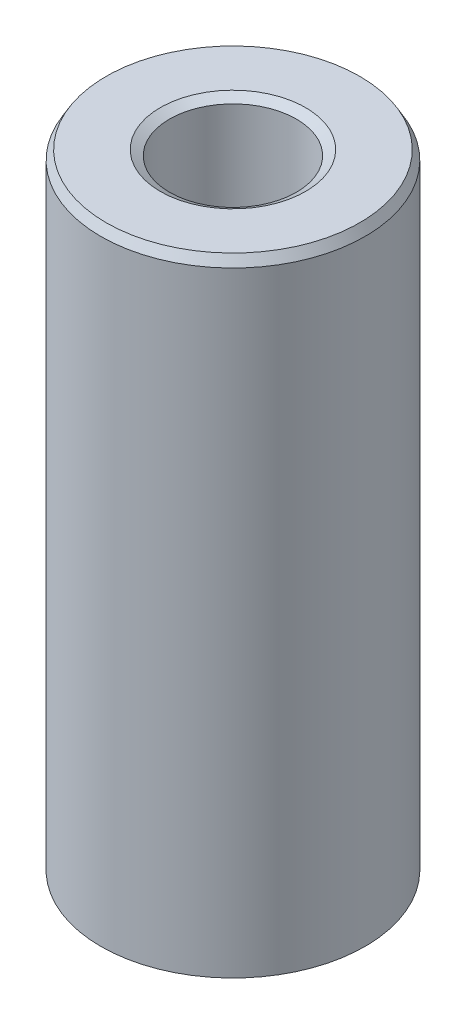
ISO-10303-21;
HEADER;
FILE_DESCRIPTION(('STEP AP214'),'2;1');
FILE_NAME('part.step','',(''),(''),'','','');
FILE_SCHEMA(('AUTOMOTIVE_DESIGN { 1 0 10303 214 1 1 1 1 }'));
ENDSEC;
DATA;
#1=APPLICATION_CONTEXT('core data for automotive mechanical design processes');
#2=APPLICATION_PROTOCOL_DEFINITION('international standard','automotive_design',2000,#1);
#3=PRODUCT_CONTEXT('',#1,'mechanical');
#4=PRODUCT('Part','Part','',(#3));
#5=PRODUCT_RELATED_PRODUCT_CATEGORY('part','',(#4));
#6=PRODUCT_DEFINITION_FORMATION('','',#4);
#7=PRODUCT_DEFINITION_CONTEXT('part definition',#1,'design');
#8=PRODUCT_DEFINITION('design','',#6,#7);
#9=PRODUCT_DEFINITION_SHAPE('','',#8);
#10=(LENGTH_UNIT() NAMED_UNIT(*) SI_UNIT(.MILLI.,.METRE.));
#11=(NAMED_UNIT(*) PLANE_ANGLE_UNIT() SI_UNIT($,.RADIAN.));
#12=(NAMED_UNIT(*) SI_UNIT($,.STERADIAN.) SOLID_ANGLE_UNIT());
#13=UNCERTAINTY_MEASURE_WITH_UNIT(LENGTH_MEASURE(1.E-05),#10,'distance_accuracy_value','');
#14=(GEOMETRIC_REPRESENTATION_CONTEXT(3) GLOBAL_UNCERTAINTY_ASSIGNED_CONTEXT((#13)) GLOBAL_UNIT_ASSIGNED_CONTEXT((#10,
#11,#12)) REPRESENTATION_CONTEXT('',''));
#15=CARTESIAN_POINT('',(0.,0.,0.));
#16=DIRECTION('',(0.,0.,1.));
#17=DIRECTION('',(1.,0.,0.));
#18=AXIS2_PLACEMENT_3D('',#15,#16,#17);
#19=CARTESIAN_POINT('',(0.,166.715926117565,0.));
#20=DIRECTION('',(0.,-1.,0.));
#21=DIRECTION('',(0.,0.,-1.));
#22=AXIS2_PLACEMENT_3D('',#19,#20,#21);
#23=CYLINDRICAL_SURFACE('',#22,35.);
#24=CARTESIAN_POINT('',(0.,1.41036586616741,0.));
#25=DIRECTION('',(0.,1.,0.));
#26=DIRECTION('',(0.,0.,1.));
#27=AXIS2_PLACEMENT_3D('',#24,#25,#26);
#28=CIRCLE('',#27,35.);
#29=CARTESIAN_POINT('',(0.,1.41036586616741,35.));
#30=VERTEX_POINT('',#29);
#31=EDGE_CURVE('E10',#30,#30,#28,.T.);
#32=ORIENTED_EDGE('',*,*,#31,.T.);
#33=EDGE_LOOP('',(#32));
#34=FACE_BOUND('',#33,.T.);
#35=CARTESIAN_POINT('',(0.,164.273100780102,0.));
#36=DIRECTION('',(0.,1.,0.));
#37=DIRECTION('',(0.,0.,1.));
#38=AXIS2_PLACEMENT_3D('',#35,#36,#37);
#39=CIRCLE('',#38,35.);
#40=CARTESIAN_POINT('',(0.,164.273100780102,35.));
#41=VERTEX_POINT('',#40);
#42=EDGE_CURVE('E50',#41,#41,#39,.F.);
#43=ORIENTED_EDGE('',*,*,#42,.T.);
#44=EDGE_LOOP('',(#43));
#45=FACE_BOUND('',#44,.T.);
#46=ADVANCED_FACE('F39',(#34,#45),#23,.T.);
#47=CARTESIAN_POINT('',(0.,166.715926117565,0.));
#48=DIRECTION('',(0.,1.,0.));
#49=DIRECTION('',(0.,0.,1.));
#50=AXIS2_PLACEMENT_3D('',#47,#48,#49);
#51=PLANE('',#50);
#52=CARTESIAN_POINT('',(0.,166.715926117565,0.));
#53=DIRECTION('',(0.,1.,0.));
#54=DIRECTION('',(0.,0.,1.));
#55=AXIS2_PLACEMENT_3D('',#52,#53,#54);
#56=CIRCLE('',#55,19.2481001896957);
#57=CARTESIAN_POINT('',(0.,166.715926117565,19.2481001896957));
#58=VERTEX_POINT('',#57);
#59=EDGE_CURVE('E58',#58,#58,#56,.F.);
#60=ORIENTED_EDGE('',*,*,#59,.T.);
#61=EDGE_LOOP('',(#60));
#62=FACE_BOUND('',#61,.T.);
#63=CARTESIAN_POINT('',(0.,166.715926117565,0.));
#64=DIRECTION('',(0.,1.,0.));
#65=DIRECTION('',(0.,0.,1.));
#66=AXIS2_PLACEMENT_3D('',#63,#64,#65);
#67=CIRCLE('',#66,33.5896341338326);
#68=CARTESIAN_POINT('',(0.,166.715926117565,33.5896341338326));
#69=VERTEX_POINT('',#68);
#70=EDGE_CURVE('E61',#69,#69,#67,.T.);
#71=ORIENTED_EDGE('',*,*,#70,.T.);
#72=EDGE_LOOP('',(#71));
#73=FACE_BOUND('',#72,.T.);
#74=ADVANCED_FACE('F88',(#62,#73),#51,.T.);
#75=CARTESIAN_POINT('',(0.,0.,0.));
#76=DIRECTION('',(0.,1.,0.));
#77=DIRECTION('',(0.,0.,1.));
#78=AXIS2_PLACEMENT_3D('',#75,#76,#77);
#79=PLANE('',#78);
#80=CARTESIAN_POINT('',(0.,0.,0.));
#81=DIRECTION('',(0.,1.,0.));
#82=DIRECTION('',(0.,0.,1.));
#83=AXIS2_PLACEMENT_3D('',#80,#81,#82);
#84=CIRCLE('',#83,18.2156407184002);
#85=CARTESIAN_POINT('',(0.,0.,-18.2156407184002));
#86=VERTEX_POINT('',#85);
#87=EDGE_CURVE('E51',#86,#86,#84,.T.);
#88=ORIENTED_EDGE('',*,*,#87,.T.);
#89=EDGE_LOOP('',(#88));
#90=FACE_BOUND('',#89,.T.);
#91=CARTESIAN_POINT('',(0.,0.,0.));
#92=DIRECTION('',(0.,1.,0.));
#93=DIRECTION('',(0.,0.,1.));
#94=AXIS2_PLACEMENT_3D('',#91,#92,#93);
#95=CIRCLE('',#94,32.5571746625372);
#96=CARTESIAN_POINT('',(0.,0.,32.5571746625372));
#97=VERTEX_POINT('',#96);
#98=EDGE_CURVE('E54',#97,#97,#95,.F.);
#99=ORIENTED_EDGE('',*,*,#98,.T.);
#100=EDGE_LOOP('',(#99));
#101=FACE_BOUND('',#100,.T.);
#102=ADVANCED_FACE('F83',(#90,#101),#79,.F.);
#103=CARTESIAN_POINT('',(0.,166.715926117565,0.));
#104=DIRECTION('',(0.,-1.,0.));
#105=DIRECTION('',(0.,0.,-1.));
#106=AXIS2_PLACEMENT_3D('',#103,#104,#105);
#107=CYLINDRICAL_SURFACE('',#106,16.8052748522328);
#108=CARTESIAN_POINT('',(0.,165.305560251397,0.));
#109=DIRECTION('',(0.,1.,0.));
#110=DIRECTION('',(0.,0.,1.));
#111=AXIS2_PLACEMENT_3D('',#108,#109,#110);
#112=CIRCLE('',#111,16.8052748522328);
#113=CARTESIAN_POINT('',(0.,165.305560251397,16.8052748522328));
#114=VERTEX_POINT('',#113);
#115=EDGE_CURVE('E67',#114,#114,#112,.T.);
#116=ORIENTED_EDGE('',*,*,#115,.T.);
#117=EDGE_LOOP('',(#116));
#118=FACE_BOUND('',#117,.T.);
#119=CARTESIAN_POINT('',(0.,2.44282533746285,0.));
#120=DIRECTION('',(0.,1.,0.));
#121=DIRECTION('',(0.,0.,1.));
#122=AXIS2_PLACEMENT_3D('',#119,#120,#121);
#123=CIRCLE('',#122,16.8052748522328);
#124=CARTESIAN_POINT('',(0.,2.44282533746284,-16.8052748522328));
#125=VERTEX_POINT('',#124);
#126=EDGE_CURVE('E69',#125,#125,#123,.F.);
#127=ORIENTED_EDGE('',*,*,#126,.T.);
#128=EDGE_LOOP('',(#127));
#129=FACE_BOUND('',#128,.T.);
#130=ADVANCED_FACE('F71',(#118,#129),#107,.F.);
#131=CARTESIAN_POINT('',(0.,165.305560251397,0.));
#132=DIRECTION('',(0.,1.,0.));
#133=DIRECTION('',(0.,0.,1.));
#134=AXIS2_PLACEMENT_3D('',#131,#132,#133);
#135=CONICAL_SURFACE('',#134,16.8052748522328,1.0471975511966);
#136=ORIENTED_EDGE('',*,*,#59,.F.);
#137=EDGE_LOOP('',(#136));
#138=FACE_BOUND('',#137,.T.);
#139=ORIENTED_EDGE('',*,*,#115,.F.);
#140=EDGE_LOOP('',(#139));
#141=FACE_BOUND('',#140,.T.);
#142=ADVANCED_FACE('F77',(#138,#141),#135,.F.);
#143=CARTESIAN_POINT('',(0.,0.,0.));
#144=DIRECTION('',(0.,-1.,0.));
#145=DIRECTION('',(0.,0.,-1.));
#146=AXIS2_PLACEMENT_3D('',#143,#144,#145);
#147=CONICAL_SURFACE('',#146,18.2156407184002,0.523598775598302);
#148=CARTESIAN_POINT('',(0.,2.44282533746284,-16.8052748522328));
#149=CARTESIAN_POINT('',(0.,2.41737924019761,-16.8199661633387));
#150=CARTESIAN_POINT('',(0.,2.39193314293237,-16.8346574744446));
#151=CARTESIAN_POINT('',(0.,2.34104094840189,-16.8640400966565));
#152=CARTESIAN_POINT('',(0.,2.31559485113665,-16.8787314077624));
#153=CARTESIAN_POINT('',(0.,2.26470265660618,-16.9081140299742));
#154=CARTESIAN_POINT('',(0.,2.23925655934094,-16.9228053410801));
#155=CARTESIAN_POINT('',(0.,2.18836436481046,-16.9521879632919));
#156=CARTESIAN_POINT('',(0.,2.16291826754523,-16.9668792743978));
#157=CARTESIAN_POINT('',(0.,2.11202607301475,-16.9962618966097));
#158=CARTESIAN_POINT('',(0.,2.08657997574951,-17.0109532077156));
#159=CARTESIAN_POINT('',(0.,2.03568778121904,-17.0403358299274));
#160=CARTESIAN_POINT('',(0.,2.0102416839538,-17.0550271410333));
#161=CARTESIAN_POINT('',(0.,1.95934948942332,-17.0844097632451));
#162=CARTESIAN_POINT('',(0.,1.93390339215808,-17.099101074351));
#163=CARTESIAN_POINT('',(0.,1.88301119762761,-17.1284836965629));
#164=CARTESIAN_POINT('',(0.,1.85756510036237,-17.1431750076688));
#165=CARTESIAN_POINT('',(0.,1.8066729058319,-17.1725576298806));
#166=CARTESIAN_POINT('',(0.,1.78122680856666,-17.1872489409865));
#167=CARTESIAN_POINT('',(0.,1.73033461403618,-17.2166315631983));
#168=CARTESIAN_POINT('',(0.,1.70488851677094,-17.2313228743042));
#169=CARTESIAN_POINT('',(0.,1.65399632224047,-17.2607054965161));
#170=CARTESIAN_POINT('',(0.,1.62855022497523,-17.275396807622));
#171=CARTESIAN_POINT('',(0.,1.57765803044475,-17.3047794298338));
#172=CARTESIAN_POINT('',(0.,1.55221193317952,-17.3194707409397));
#173=CARTESIAN_POINT('',(0.,1.50131973864904,-17.3488533631515));
#174=CARTESIAN_POINT('',(0.,1.4758736413838,-17.3635446742574));
#175=CARTESIAN_POINT('',(0.,1.42498144685333,-17.3929272964692));
#176=CARTESIAN_POINT('',(0.,1.39953534958809,-17.4076186075752));
#177=CARTESIAN_POINT('',(0.,1.34864315505761,-17.437001229787));
#178=CARTESIAN_POINT('',(0.,1.32319705779237,-17.4516925408929));
#179=CARTESIAN_POINT('',(0.,1.2723048632619,-17.4810751631047));
#180=CARTESIAN_POINT('',(0.,1.24685876599666,-17.4957664742106));
#181=CARTESIAN_POINT('',(0.,1.19596657146618,-17.5251490964224));
#182=CARTESIAN_POINT('',(0.,1.17052047420095,-17.5398404075284));
#183=CARTESIAN_POINT('',(0.,1.11962827967047,-17.5692230297402));
#184=CARTESIAN_POINT('',(0.,1.09418218240523,-17.5839143408461));
#185=CARTESIAN_POINT('',(0.,1.04328998787476,-17.6132969630579));
#186=CARTESIAN_POINT('',(0.,1.01784389060952,-17.6279882741638));
#187=CARTESIAN_POINT('',(0.,0.966951696079042,-17.6573708963756));
#188=CARTESIAN_POINT('',(0.,0.941505598813805,-17.6720622074816));
#189=CARTESIAN_POINT('',(0.,0.890613404283329,-17.7014448296934));
#190=CARTESIAN_POINT('',(0.,0.865167307018091,-17.7161361407993));
#191=CARTESIAN_POINT('',(0.,0.814275112487615,-17.7455187630111));
#192=CARTESIAN_POINT('',(0.,0.788829015222377,-17.760210074117));
#193=CARTESIAN_POINT('',(0.,0.737936820691901,-17.7895926963288));
#194=CARTESIAN_POINT('',(0.,0.712490723426663,-17.8042840074348));
#195=CARTESIAN_POINT('',(0.,0.661598528896187,-17.8336666296466));
#196=CARTESIAN_POINT('',(0.,0.636152431630949,-17.8483579407525));
#197=CARTESIAN_POINT('',(0.,0.585260237100473,-17.8777405629643));
#198=CARTESIAN_POINT('',(0.,0.559814139835235,-17.8924318740702));
#199=CARTESIAN_POINT('',(0.,0.50892194530476,-17.921814496282));
#200=CARTESIAN_POINT('',(0.,0.483475848039521,-17.9365058073879));
#201=CARTESIAN_POINT('',(0.,0.432583653509045,-17.9658884295998));
#202=CARTESIAN_POINT('',(0.,0.407137556243807,-17.9805797407057));
#203=CARTESIAN_POINT('',(0.,0.356245361713331,-18.0099623629175));
#204=CARTESIAN_POINT('',(0.,0.330799264448094,-18.0246536740234));
#205=CARTESIAN_POINT('',(0.,0.279907069917618,-18.0540362962352));
#206=CARTESIAN_POINT('',(0.,0.25446097265238,-18.0687276073411));
#207=CARTESIAN_POINT('',(0.,0.203568778121904,-18.098110229553));
#208=CARTESIAN_POINT('',(0.,0.178122680856665,-18.1128015406589));
#209=CARTESIAN_POINT('',(0.,0.12723048632619,-18.1421841628707));
#210=CARTESIAN_POINT('',(0.,0.101784389060952,-18.1568754739766));
#211=CARTESIAN_POINT('',(0.,0.0508921945304764,-18.1862580961884));
#212=CARTESIAN_POINT('',(0.,0.0254460972652387,-18.2009494072943));
#213=CARTESIAN_POINT('',(0.,0.,-18.2156407184002));
#214=B_SPLINE_CURVE_WITH_KNOTS('',3,(#148,#149,#150,#151,#152,#153,#154,#155,#156,#157,#158,
#159,#160,#161,#162,#163,#164,#165,#166,#167,#168,#169,#170,#171,#172,#173,#174,#175,#176,#177,
#178,#179,#180,#181,#182,#183,#184,#185,#186,#187,#188,#189,#190,#191,#192,#193,#194,#195,#196,
#197,#198,#199,#200,#201,#202,#203,#204,#205,#206,#207,#208,#209,#210,#211,#212,#213),
.UNSPECIFIED.,.F.,.F.,(4,2,2,2,2,2,2,2,2,2,2,2,2,2,2,2,2,2,2,2,2,2,2,2,2,2,2,2,2,2,2,2,4),(0.,
0.0881478666354628,0.176295733270927,0.26444359990639,0.352591466541853,0.440739333177318,
0.52888719981278,0.617035066448243,0.705182933083708,0.79333079971917,0.881478666354633,
0.969626532990098,1.05777439962556,1.14592226626102,1.23407013289649,1.32221799953195,
1.41036586616741,1.49851373280288,1.58666159943834,1.6748094660738,1.76295733270927,
1.85110519934473,1.9392530659802,2.02740093261566,2.11554879925112,2.20369666588659,
2.29184453252205,2.37999239915751,2.46814026579298,2.55628813242844,2.6444359990639,
2.73258386569937,2.82073173233483),.UNSPECIFIED.);
#215=EDGE_CURVE('BSEAM73',#125,#86,#214,.T.);
#216=ORIENTED_EDGE('',*,*,#126,.F.);
#217=ORIENTED_EDGE('',*,*,#87,.F.);
#218=ORIENTED_EDGE('',*,*,#215,.T.);
#219=ORIENTED_EDGE('',*,*,#215,.F.);
#220=EDGE_LOOP('',(#216,#218,#217,#219));
#221=FACE_BOUND('',#220,.T.);
#222=ADVANCED_FACE('F73',(#221),#147,.F.);
#223=CARTESIAN_POINT('',(0.,1.41036586616741,0.));
#224=DIRECTION('',(0.,1.,0.));
#225=DIRECTION('',(0.,0.,1.));
#226=AXIS2_PLACEMENT_3D('',#223,#224,#225);
#227=CONICAL_SURFACE('',#226,35.,1.04719755119659);
#228=ORIENTED_EDGE('',*,*,#98,.F.);
#229=EDGE_LOOP('',(#228));
#230=FACE_BOUND('',#229,.T.);
#231=ORIENTED_EDGE('',*,*,#31,.F.);
#232=EDGE_LOOP('',(#231));
#233=FACE_BOUND('',#232,.T.);
#234=ADVANCED_FACE('F76',(#230,#233),#227,.T.);
#235=CARTESIAN_POINT('',(0.,166.715926117565,0.));
#236=DIRECTION('',(0.,-1.,0.));
#237=DIRECTION('',(0.,0.,-1.));
#238=AXIS2_PLACEMENT_3D('',#235,#236,#237);
#239=CONICAL_SURFACE('',#238,33.5896341338326,0.523598775598291);
#240=ORIENTED_EDGE('',*,*,#42,.F.);
#241=EDGE_LOOP('',(#240));
#242=FACE_BOUND('',#241,.T.);
#243=ORIENTED_EDGE('',*,*,#70,.F.);
#244=EDGE_LOOP('',(#243));
#245=FACE_BOUND('',#244,.T.);
#246=ADVANCED_FACE('F45',(#242,#245),#239,.T.);
#247=CLOSED_SHELL('',(#46,#74,#102,#130,#142,#222,#234,#246));
#248=MANIFOLD_SOLID_BREP('B2',#247);
#249=ADVANCED_BREP_SHAPE_REPRESENTATION('',(#18,#248),#14);
#250=SHAPE_DEFINITION_REPRESENTATION(#9,#249);
ENDSEC;
END-ISO-10303-21;
